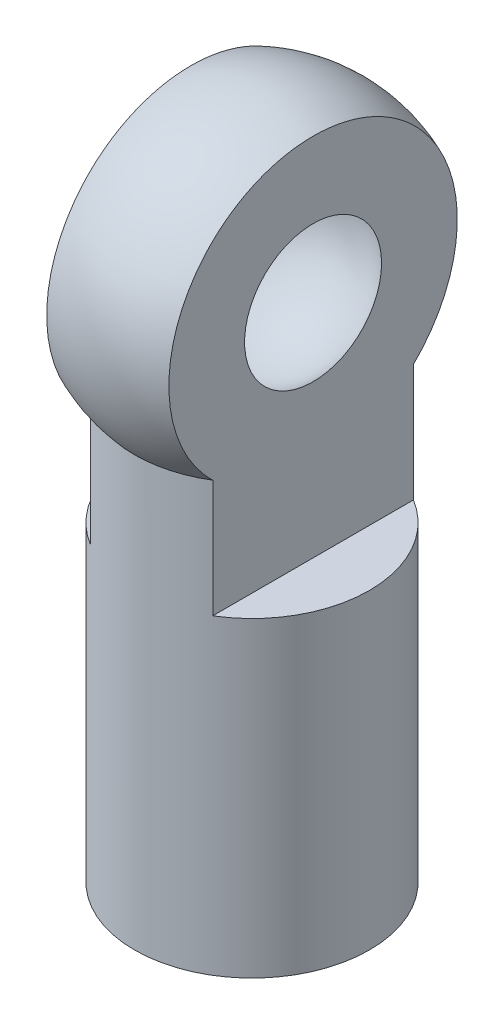
ISO-10303-21;
HEADER;
FILE_DESCRIPTION(('STEP AP214'),'2;1');
FILE_NAME('part.step','',(''),(''),'','','');
FILE_SCHEMA(('AUTOMOTIVE_DESIGN { 1 0 10303 214 1 1 1 1 }'));
ENDSEC;
DATA;
#1=APPLICATION_CONTEXT('core data for automotive mechanical design processes');
#2=APPLICATION_PROTOCOL_DEFINITION('international standard','automotive_design',2000,#1);
#3=PRODUCT_CONTEXT('',#1,'mechanical');
#4=PRODUCT('Part','Part','',(#3));
#5=PRODUCT_RELATED_PRODUCT_CATEGORY('part','',(#4));
#6=PRODUCT_DEFINITION_FORMATION('','',#4);
#7=PRODUCT_DEFINITION_CONTEXT('part definition',#1,'design');
#8=PRODUCT_DEFINITION('design','',#6,#7);
#9=PRODUCT_DEFINITION_SHAPE('','',#8);
#10=(LENGTH_UNIT() NAMED_UNIT(*) SI_UNIT(.MILLI.,.METRE.));
#11=(NAMED_UNIT(*) PLANE_ANGLE_UNIT() SI_UNIT($,.RADIAN.));
#12=(NAMED_UNIT(*) SI_UNIT($,.STERADIAN.) SOLID_ANGLE_UNIT());
#13=UNCERTAINTY_MEASURE_WITH_UNIT(LENGTH_MEASURE(1.E-05),#10,'distance_accuracy_value','');
#14=(GEOMETRIC_REPRESENTATION_CONTEXT(3) GLOBAL_UNCERTAINTY_ASSIGNED_CONTEXT((#13)) GLOBAL_UNIT_ASSIGNED_CONTEXT((#10,
#11,#12)) REPRESENTATION_CONTEXT('',''));
#15=CARTESIAN_POINT('',(0.,0.,0.));
#16=DIRECTION('',(0.,0.,1.));
#17=DIRECTION('',(1.,0.,0.));
#18=AXIS2_PLACEMENT_3D('',#15,#16,#17);
#19=CARTESIAN_POINT('',(0.,26.7885700742442,0.));
#20=DIRECTION('',(0.,1.,0.));
#21=DIRECTION('',(0.,0.,1.));
#22=AXIS2_PLACEMENT_3D('',#19,#20,#21);
#23=CYLINDRICAL_SURFACE('',#22,3.75);
#24=CARTESIAN_POINT('',(0.,0.,0.));
#25=DIRECTION('',(0.,1.,0.));
#26=DIRECTION('',(0.,0.,1.));
#27=AXIS2_PLACEMENT_3D('',#24,#25,#26);
#28=CIRCLE('',#27,3.75);
#29=CARTESIAN_POINT('',(0.,0.,3.75));
#30=VERTEX_POINT('',#29);
#31=EDGE_CURVE('E109',#30,#30,#28,.T.);
#32=ORIENTED_EDGE('',*,*,#31,.T.);
#33=EDGE_LOOP('',(#32));
#34=FACE_BOUND('',#33,.T.);
#35=DIRECTION('',(0.,1.,0.));
#36=VECTOR('',#35,1.);
#37=CARTESIAN_POINT('',(-1.95,26.7885700742442,3.20312347560939));
#38=LINE('',#37,#36);
#39=CARTESIAN_POINT('',(-1.95,9.94281086116926,3.20312347560939));
#40=VERTEX_POINT('',#39);
#41=CARTESIAN_POINT('',(-1.95,13.6928108611693,3.20312347560939));
#42=VERTEX_POINT('',#41);
#43=EDGE_CURVE('E57',#40,#42,#38,.T.);
#44=ORIENTED_EDGE('',*,*,#43,.F.);
#45=CARTESIAN_POINT('',(0.,9.94281086116926,0.));
#46=DIRECTION('',(0.,-1.,0.));
#47=DIRECTION('',(0.,0.,-1.));
#48=AXIS2_PLACEMENT_3D('',#45,#46,#47);
#49=CIRCLE('',#48,3.75);
#50=CARTESIAN_POINT('',(-1.95,9.94281086116926,-3.20312347560939));
#51=VERTEX_POINT('',#50);
#52=EDGE_CURVE('E11',#40,#51,#49,.T.);
#53=ORIENTED_EDGE('',*,*,#52,.T.);
#54=DIRECTION('',(0.,1.,0.));
#55=VECTOR('',#54,1.);
#56=CARTESIAN_POINT('',(-1.95,26.7885700742442,-3.20312347560939));
#57=LINE('',#56,#55);
#58=CARTESIAN_POINT('',(-1.95,13.6928108611693,-3.20312347560939));
#59=VERTEX_POINT('',#58);
#60=EDGE_CURVE('E90',#59,#51,#57,.F.);
#61=ORIENTED_EDGE('',*,*,#60,.F.);
#62=CARTESIAN_POINT('',(0.,13.6928108611693,0.));
#63=DIRECTION('',(0.,1.,0.));
#64=DIRECTION('',(0.,0.,1.));
#65=AXIS2_PLACEMENT_3D('',#62,#63,#64);
#66=CIRCLE('',#65,3.75);
#67=CARTESIAN_POINT('',(1.95,13.6928108611693,-3.20312347560939));
#68=VERTEX_POINT('',#67);
#69=EDGE_CURVE('E112',#68,#59,#66,.T.);
#70=ORIENTED_EDGE('',*,*,#69,.F.);
#71=DIRECTION('',(0.,1.,0.));
#72=VECTOR('',#71,1.);
#73=CARTESIAN_POINT('',(1.95,26.7885700742442,-3.20312347560939));
#74=LINE('',#73,#72);
#75=CARTESIAN_POINT('',(1.95,9.94281086116926,-3.20312347560939));
#76=VERTEX_POINT('',#75);
#77=EDGE_CURVE('E65',#76,#68,#74,.T.);
#78=ORIENTED_EDGE('',*,*,#77,.F.);
#79=CARTESIAN_POINT('',(0.,9.94281086116926,0.));
#80=DIRECTION('',(0.,1.,0.));
#81=DIRECTION('',(0.,0.,1.));
#82=AXIS2_PLACEMENT_3D('',#79,#80,#81);
#83=CIRCLE('',#82,3.75);
#84=CARTESIAN_POINT('',(1.95,9.94281086116926,3.20312347560939));
#85=VERTEX_POINT('',#84);
#86=EDGE_CURVE('E50',#85,#76,#83,.T.);
#87=ORIENTED_EDGE('',*,*,#86,.F.);
#88=DIRECTION('',(0.,1.,0.));
#89=VECTOR('',#88,1.);
#90=CARTESIAN_POINT('',(1.95,26.7885700742442,3.20312347560939));
#91=LINE('',#90,#89);
#92=CARTESIAN_POINT('',(1.95,13.6928108611693,3.20312347560939));
#93=VERTEX_POINT('',#92);
#94=EDGE_CURVE('E106',#93,#85,#91,.F.);
#95=ORIENTED_EDGE('',*,*,#94,.F.);
#96=EDGE_CURVE('E95',#42,#93,#66,.T.);
#97=ORIENTED_EDGE('',*,*,#96,.F.);
#98=EDGE_LOOP('',(#44,#53,#61,#70,#78,#87,#95,#97));
#99=FACE_BOUND('',#98,.T.);
#100=ADVANCED_FACE('F42',(#34,#99),#23,.T.);
#101=CARTESIAN_POINT('',(0.,17.,0.));
#102=DIRECTION('',(0.,1.,0.));
#103=DIRECTION('',(1.,0.,0.));
#104=AXIS2_PLACEMENT_3D('',#101,#102,#103);
#105=SPHERICAL_SURFACE('',#104,5.);
#106=CARTESIAN_POINT('',(-1.95,17.,0.));
#107=DIRECTION('',(-1.,0.,0.));
#108=DIRECTION('',(0.,0.,1.));
#109=AXIS2_PLACEMENT_3D('',#106,#107,#108);
#110=CIRCLE('',#109,4.60407428263272);
#111=EDGE_CURVE('E100',#42,#59,#110,.T.);
#112=ORIENTED_EDGE('',*,*,#111,.F.);
#113=ORIENTED_EDGE('',*,*,#96,.T.);
#114=CARTESIAN_POINT('',(1.95,17.,0.));
#115=DIRECTION('',(1.,0.,0.));
#116=DIRECTION('',(0.,0.,-1.));
#117=AXIS2_PLACEMENT_3D('',#114,#115,#116);
#118=CIRCLE('',#117,4.60407428263272);
#119=EDGE_CURVE('E104',#68,#93,#118,.T.);
#120=ORIENTED_EDGE('',*,*,#119,.F.);
#121=ORIENTED_EDGE('',*,*,#69,.T.);
#122=EDGE_LOOP('',(#112,#113,#120,#121));
#123=FACE_BOUND('',#122,.T.);
#124=ADVANCED_FACE('F140',(#123),#105,.T.);
#125=CARTESIAN_POINT('',(0.,17.,0.));
#126=DIRECTION('',(0.,1.,0.));
#127=DIRECTION('',(1.,0.,0.));
#128=AXIS2_PLACEMENT_3D('',#125,#126,#127);
#129=SPHERICAL_SURFACE('',#128,2.93);
#130=CARTESIAN_POINT('',(0.,17.,0.));
#131=DIRECTION('',(1.,0.,0.));
#132=DIRECTION('',(0.,0.,-1.));
#133=AXIS2_PLACEMENT_3D('',#130,#131,#132);
#134=SPHERICAL_SURFACE('',#133,2.93);
#135=CARTESIAN_POINT('',(1.95,17.,0.));
#136=DIRECTION('',(1.,0.,0.));
#137=DIRECTION('',(0.,0.,-1.));
#138=AXIS2_PLACEMENT_3D('',#135,#136,#137);
#139=CIRCLE('',#138,2.18686990925387);
#140=CARTESIAN_POINT('',(1.95,17.,-2.18686990925387));
#141=VERTEX_POINT('',#140);
#142=EDGE_CURVE('E98',#141,#141,#139,.T.);
#143=ORIENTED_EDGE('',*,*,#142,.T.);
#144=EDGE_LOOP('',(#143));
#145=FACE_BOUND('',#144,.T.);
#146=CARTESIAN_POINT('',(-1.95,17.,0.));
#147=DIRECTION('',(-1.,0.,0.));
#148=DIRECTION('',(0.,0.,1.));
#149=AXIS2_PLACEMENT_3D('',#146,#147,#148);
#150=CIRCLE('',#149,2.18686990925387);
#151=CARTESIAN_POINT('',(-1.95,17.,2.18686990925387));
#152=VERTEX_POINT('',#151);
#153=EDGE_CURVE('E91',#152,#152,#150,.T.);
#154=ORIENTED_EDGE('',*,*,#153,.T.);
#155=EDGE_LOOP('',(#154));
#156=FACE_BOUND('',#155,.T.);
#157=ADVANCED_FACE('F135',(#145,#156),#134,.F.);
#158=CARTESIAN_POINT('',(0.,0.,0.));
#159=DIRECTION('',(0.,1.,0.));
#160=DIRECTION('',(0.,0.,1.));
#161=AXIS2_PLACEMENT_3D('',#158,#159,#160);
#162=PLANE('',#161);
#163=CARTESIAN_POINT('',(0.,0.,0.));
#164=DIRECTION('',(0.,1.,0.));
#165=DIRECTION('',(0.,0.,1.));
#166=AXIS2_PLACEMENT_3D('',#163,#164,#165);
#167=CIRCLE('',#166,1.5);
#168=CARTESIAN_POINT('',(0.,0.,1.5));
#169=VERTEX_POINT('',#168);
#170=EDGE_CURVE('E45',#169,#169,#167,.F.);
#171=ORIENTED_EDGE('',*,*,#170,.F.);
#172=EDGE_LOOP('',(#171));
#173=FACE_BOUND('',#172,.T.);
#174=ORIENTED_EDGE('',*,*,#31,.F.);
#175=EDGE_LOOP('',(#174));
#176=FACE_BOUND('',#175,.T.);
#177=ADVANCED_FACE('F131',(#173,#176),#162,.F.);
#178=CARTESIAN_POINT('',(5.,9.94281086116926,0.));
#179=DIRECTION('',(0.,1.,0.));
#180=DIRECTION('',(0.,0.,1.));
#181=AXIS2_PLACEMENT_3D('',#178,#179,#180);
#182=PLANE('',#181);
#183=ORIENTED_EDGE('',*,*,#86,.T.);
#184=DIRECTION('',(0.,0.,-1.));
#185=VECTOR('',#184,1.);
#186=CARTESIAN_POINT('',(1.95,9.94281086116926,0.));
#187=LINE('',#186,#185);
#188=EDGE_CURVE('E96',#85,#76,#187,.T.);
#189=ORIENTED_EDGE('',*,*,#188,.F.);
#190=EDGE_LOOP('',(#183,#189));
#191=FACE_BOUND('',#190,.T.);
#192=ADVANCED_FACE('F134',(#191),#182,.T.);
#193=CARTESIAN_POINT('',(1.95,0.,0.));
#194=DIRECTION('',(1.,0.,0.));
#195=DIRECTION('',(0.,0.,-1.));
#196=AXIS2_PLACEMENT_3D('',#193,#194,#195);
#197=PLANE('',#196);
#198=ORIENTED_EDGE('',*,*,#142,.F.);
#199=EDGE_LOOP('',(#198));
#200=FACE_BOUND('',#199,.T.);
#201=ORIENTED_EDGE('',*,*,#77,.T.);
#202=ORIENTED_EDGE('',*,*,#119,.T.);
#203=ORIENTED_EDGE('',*,*,#94,.T.);
#204=ORIENTED_EDGE('',*,*,#188,.T.);
#205=EDGE_LOOP('',(#201,#202,#203,#204));
#206=FACE_BOUND('',#205,.T.);
#207=ADVANCED_FACE('F154',(#200,#206),#197,.T.);
#208=CARTESIAN_POINT('',(-5.,9.94281086116926,0.));
#209=DIRECTION('',(0.,-1.,0.));
#210=DIRECTION('',(0.,0.,-1.));
#211=AXIS2_PLACEMENT_3D('',#208,#209,#210);
#212=PLANE('',#211);
#213=DIRECTION('',(0.,0.,-1.));
#214=VECTOR('',#213,1.);
#215=CARTESIAN_POINT('',(-1.95,9.94281086116926,0.));
#216=LINE('',#215,#214);
#217=EDGE_CURVE('E86',#40,#51,#216,.T.);
#218=ORIENTED_EDGE('',*,*,#217,.T.);
#219=ORIENTED_EDGE('',*,*,#52,.F.);
#220=EDGE_LOOP('',(#218,#219));
#221=FACE_BOUND('',#220,.T.);
#222=ADVANCED_FACE('F85',(#221),#212,.F.);
#223=CARTESIAN_POINT('',(-1.95,0.,0.));
#224=DIRECTION('',(-1.,0.,0.));
#225=DIRECTION('',(0.,0.,-1.));
#226=AXIS2_PLACEMENT_3D('',#223,#224,#225);
#227=PLANE('',#226);
#228=ORIENTED_EDGE('',*,*,#153,.F.);
#229=EDGE_LOOP('',(#228));
#230=FACE_BOUND('',#229,.T.);
#231=ORIENTED_EDGE('',*,*,#43,.T.);
#232=ORIENTED_EDGE('',*,*,#111,.T.);
#233=ORIENTED_EDGE('',*,*,#60,.T.);
#234=ORIENTED_EDGE('',*,*,#217,.F.);
#235=EDGE_LOOP('',(#231,#232,#233,#234));
#236=FACE_BOUND('',#235,.T.);
#237=ADVANCED_FACE('F89',(#230,#236),#227,.T.);
#238=CARTESIAN_POINT('',(0.,-1.2E-05,0.));
#239=DIRECTION('',(0.,1.,0.));
#240=DIRECTION('',(0.,0.,1.));
#241=AXIS2_PLACEMENT_3D('',#238,#239,#240);
#242=CYLINDRICAL_SURFACE('',#241,1.5);
#243=CARTESIAN_POINT('',(0.,10.,0.));
#244=DIRECTION('',(0.,-1.,0.));
#245=DIRECTION('',(0.,0.,-1.));
#246=AXIS2_PLACEMENT_3D('',#243,#244,#245);
#247=CIRCLE('',#246,1.5);
#248=CARTESIAN_POINT('',(0.,10.,-1.5));
#249=VERTEX_POINT('',#248);
#250=EDGE_CURVE('E122',#249,#249,#247,.T.);
#251=ORIENTED_EDGE('',*,*,#250,.F.);
#252=EDGE_LOOP('',(#251));
#253=FACE_BOUND('',#252,.T.);
#254=ORIENTED_EDGE('',*,*,#170,.T.);
#255=EDGE_LOOP('',(#254));
#256=FACE_BOUND('',#255,.T.);
#257=ADVANCED_FACE('F129',(#253,#256),#242,.F.);
#258=CARTESIAN_POINT('',(0.,10.,0.));
#259=DIRECTION('',(0.,-1.,0.));
#260=DIRECTION('',(0.,0.,-1.));
#261=AXIS2_PLACEMENT_3D('',#258,#259,#260);
#262=PLANE('',#261);
#263=ORIENTED_EDGE('',*,*,#250,.T.);
#264=EDGE_LOOP('',(#263));
#265=FACE_BOUND('',#264,.T.);
#266=ADVANCED_FACE('F165',(#265),#262,.T.);
#267=CLOSED_SHELL('',(#100,#124,#157,#177,#192,#207,#222,#237,#257,#266));
#268=MANIFOLD_SOLID_BREP('B2',#267);
#269=ADVANCED_BREP_SHAPE_REPRESENTATION('',(#18,#268),#14);
#270=SHAPE_DEFINITION_REPRESENTATION(#9,#269);
ENDSEC;
END-ISO-10303-21;
